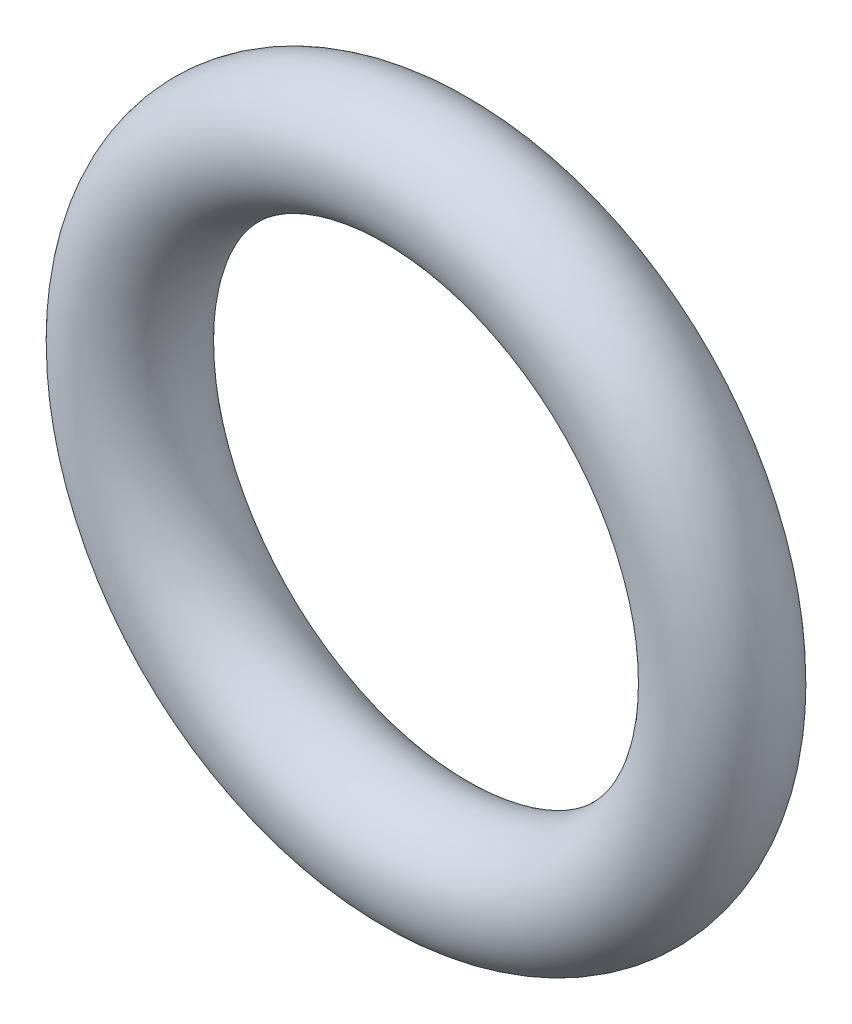
ISO-10303-21;
HEADER;
FILE_DESCRIPTION(('STEP AP214'),'2;1');
FILE_NAME('part.step','',(''),(''),'','','');
FILE_SCHEMA(('AUTOMOTIVE_DESIGN { 1 0 10303 214 1 1 1 1 }'));
ENDSEC;
DATA;
#1=APPLICATION_CONTEXT('core data for automotive mechanical design processes');
#2=APPLICATION_PROTOCOL_DEFINITION('international standard','automotive_design',2000,#1);
#3=PRODUCT_CONTEXT('',#1,'mechanical');
#4=PRODUCT('Part','Part','',(#3));
#5=PRODUCT_RELATED_PRODUCT_CATEGORY('part','',(#4));
#6=PRODUCT_DEFINITION_FORMATION('','',#4);
#7=PRODUCT_DEFINITION_CONTEXT('part definition',#1,'design');
#8=PRODUCT_DEFINITION('design','',#6,#7);
#9=PRODUCT_DEFINITION_SHAPE('','',#8);
#10=(LENGTH_UNIT() NAMED_UNIT(*) SI_UNIT(.MILLI.,.METRE.));
#11=(NAMED_UNIT(*) PLANE_ANGLE_UNIT() SI_UNIT($,.RADIAN.));
#12=(NAMED_UNIT(*) SI_UNIT($,.STERADIAN.) SOLID_ANGLE_UNIT());
#13=UNCERTAINTY_MEASURE_WITH_UNIT(LENGTH_MEASURE(1.E-05),#10,'distance_accuracy_value','');
#14=(GEOMETRIC_REPRESENTATION_CONTEXT(3) GLOBAL_UNCERTAINTY_ASSIGNED_CONTEXT((#13)) GLOBAL_UNIT_ASSIGNED_CONTEXT((#10,
#11,#12)) REPRESENTATION_CONTEXT('',''));
#15=CARTESIAN_POINT('',(0.,0.,0.));
#16=DIRECTION('',(0.,0.,1.));
#17=DIRECTION('',(1.,0.,0.));
#18=AXIS2_PLACEMENT_3D('',#15,#16,#17);
#19=CARTESIAN_POINT('',(0.,0.,0.));
#20=DIRECTION('',(0.,0.,-0.999999999999996));
#21=DIRECTION('',(-1.,0.,0.));
#22=AXIS2_PLACEMENT_3D('',#19,#20,#21);
#23=TOROIDAL_SURFACE('',#22,5.08,1.016);
#24=CARTESIAN_POINT('',(-6.09600000000001,0.,0.));
#25=VERTEX_POINT('',#24);
#26=VERTEX_LOOP('',#25);
#27=FACE_BOUND('',#26,.T.);
#28=ADVANCED_FACE('F30',(#27),#23,.T.);
#29=CLOSED_SHELL('',(#28));
#30=MANIFOLD_SOLID_BREP('B2',#29);
#31=ADVANCED_BREP_SHAPE_REPRESENTATION('',(#18,#30),#14);
#32=SHAPE_DEFINITION_REPRESENTATION(#9,#31);
ENDSEC;
END-ISO-10303-21;
